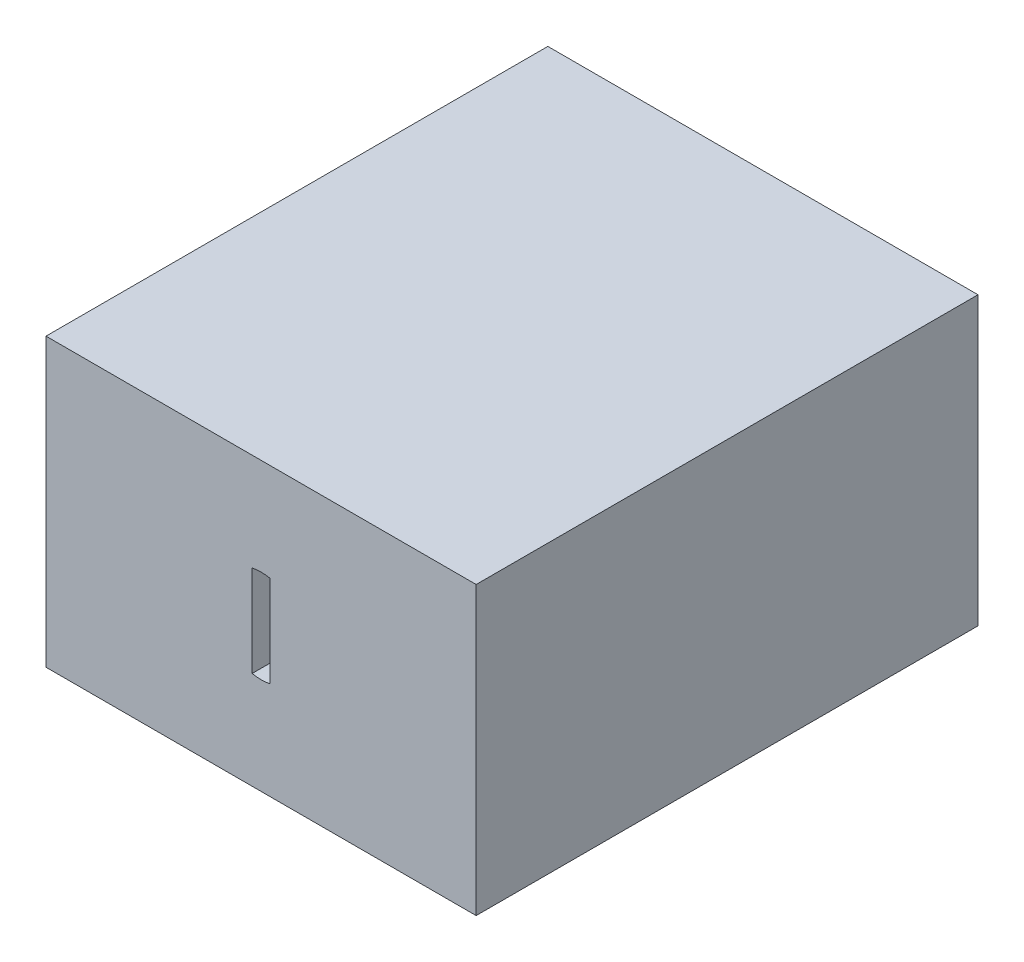
ISO-10303-21;
HEADER;
FILE_DESCRIPTION(('STEP AP214'),'2;1');
FILE_NAME('part.step','',(''),(''),'','','');
FILE_SCHEMA(('AUTOMOTIVE_DESIGN { 1 0 10303 214 1 1 1 1 }'));
ENDSEC;
DATA;
#1=APPLICATION_CONTEXT('core data for automotive mechanical design processes');
#2=APPLICATION_PROTOCOL_DEFINITION('international standard','automotive_design',2000,#1);
#3=PRODUCT_CONTEXT('',#1,'mechanical');
#4=PRODUCT('Part','Part','',(#3));
#5=PRODUCT_RELATED_PRODUCT_CATEGORY('part','',(#4));
#6=PRODUCT_DEFINITION_FORMATION('','',#4);
#7=PRODUCT_DEFINITION_CONTEXT('part definition',#1,'design');
#8=PRODUCT_DEFINITION('design','',#6,#7);
#9=PRODUCT_DEFINITION_SHAPE('','',#8);
#10=(LENGTH_UNIT() NAMED_UNIT(*) SI_UNIT(.MILLI.,.METRE.));
#11=(NAMED_UNIT(*) PLANE_ANGLE_UNIT() SI_UNIT($,.RADIAN.));
#12=(NAMED_UNIT(*) SI_UNIT($,.STERADIAN.) SOLID_ANGLE_UNIT());
#13=UNCERTAINTY_MEASURE_WITH_UNIT(LENGTH_MEASURE(1.E-05),#10,'distance_accuracy_value','');
#14=(GEOMETRIC_REPRESENTATION_CONTEXT(3) GLOBAL_UNCERTAINTY_ASSIGNED_CONTEXT((#13)) GLOBAL_UNIT_ASSIGNED_CONTEXT((#10,
#11,#12)) REPRESENTATION_CONTEXT('',''));
#15=CARTESIAN_POINT('',(0.,0.,0.));
#16=DIRECTION('',(0.,0.,1.));
#17=DIRECTION('',(1.,0.,0.));
#18=AXIS2_PLACEMENT_3D('',#15,#16,#17);
#19=CARTESIAN_POINT('',(-32.8183082101523,-7.19214017713193,-54.7013246195609));
#20=DIRECTION('',(0.,-1.,0.));
#21=DIRECTION('',(0.,0.,-1.));
#22=AXIS2_PLACEMENT_3D('',#19,#20,#21);
#23=PLANE('',#22);
#24=DIRECTION('',(-1.,0.,0.));
#25=VECTOR('',#24,1.);
#26=CARTESIAN_POINT('',(-32.8183082101523,-7.19214017713193,-62.2013246195609));
#27=LINE('',#26,#25);
#28=CARTESIAN_POINT('',(-32.8183082101523,-7.19214017713193,-62.2013246195609));
#29=VERTEX_POINT('',#28);
#30=CARTESIAN_POINT('',(-33.8933082101523,-7.19214017713193,-62.2013246195608));
#31=VERTEX_POINT('',#30);
#32=EDGE_CURVE('E422',#29,#31,#27,.T.);
#33=ORIENTED_EDGE('',*,*,#32,.T.);
#34=DIRECTION('',(0.,0.,1.));
#35=VECTOR('',#34,1.);
#36=CARTESIAN_POINT('',(-33.8933082101523,-7.19214017713193,-58.7013246195608));
#37=LINE('',#36,#35);
#38=CARTESIAN_POINT('',(-33.8933082101523,-7.19214017713193,-58.7013246195608));
#39=VERTEX_POINT('',#38);
#40=EDGE_CURVE('E282',#31,#39,#37,.T.);
#41=ORIENTED_EDGE('',*,*,#40,.T.);
#42=DIRECTION('',(0.,0.,-1.));
#43=VECTOR('',#42,1.);
#44=CARTESIAN_POINT('',(-33.8933082101523,-7.19214017713193,-54.7013246195609));
#45=LINE('',#44,#43);
#46=CARTESIAN_POINT('',(-33.8933082101523,-7.19214017713193,-54.7013246195608));
#47=VERTEX_POINT('',#46);
#48=EDGE_CURVE('E368',#47,#39,#45,.T.);
#49=ORIENTED_EDGE('',*,*,#48,.F.);
#50=DIRECTION('',(-1.,0.,0.));
#51=VECTOR('',#50,1.);
#52=CARTESIAN_POINT('',(-32.8183082101523,-7.19214017713193,-54.7013246195609));
#53=LINE('',#52,#51);
#54=CARTESIAN_POINT('',(-32.8183082101523,-7.19214017713193,-54.7013246195609));
#55=VERTEX_POINT('',#54);
#56=EDGE_CURVE('E398',#55,#47,#53,.T.);
#57=ORIENTED_EDGE('',*,*,#56,.F.);
#58=DIRECTION('',(0.,0.,-1.));
#59=VECTOR('',#58,1.);
#60=CARTESIAN_POINT('',(-32.8183082101523,-7.19214017713193,-54.7013246195609));
#61=LINE('',#60,#59);
#62=EDGE_CURVE('E444',#55,#29,#61,.T.);
#63=ORIENTED_EDGE('',*,*,#62,.T.);
#64=EDGE_LOOP('',(#33,#41,#49,#57,#63));
#65=FACE_BOUND('',#64,.T.);
#66=ADVANCED_FACE('F39',(#65),#23,.F.);
#67=DIRECTION('',(0.,0.,1.));
#68=VECTOR('',#67,1.);
#69=CARTESIAN_POINT('',(-38.0933082101523,-7.19214017713193,-54.7013246195609));
#70=LINE('',#69,#68);
#71=CARTESIAN_POINT('',(-38.0933082101523,-7.19214017713193,-58.7013246195608));
#72=VERTEX_POINT('',#71);
#73=CARTESIAN_POINT('',(-38.0933082101523,-7.19214017713193,-54.7013246195609));
#74=VERTEX_POINT('',#73);
#75=EDGE_CURVE('E373',#72,#74,#70,.T.);
#76=ORIENTED_EDGE('',*,*,#75,.F.);
#77=DIRECTION('',(0.,0.,-1.));
#78=VECTOR('',#77,1.);
#79=CARTESIAN_POINT('',(-38.0933082101523,-7.19214017713193,-58.7013246195608));
#80=LINE('',#79,#78);
#81=CARTESIAN_POINT('',(-38.0933082101523,-7.19214017713193,-62.2013246195608));
#82=VERTEX_POINT('',#81);
#83=EDGE_CURVE('E294',#72,#82,#80,.T.);
#84=ORIENTED_EDGE('',*,*,#83,.T.);
#85=CARTESIAN_POINT('',(-39.1683082101523,-7.19214017713193,-62.2013246195609));
#86=VERTEX_POINT('',#85);
#87=EDGE_CURVE('E421',#82,#86,#27,.T.);
#88=ORIENTED_EDGE('',*,*,#87,.T.);
#89=DIRECTION('',(0.,0.,-1.));
#90=VECTOR('',#89,1.);
#91=CARTESIAN_POINT('',(-39.1683082101523,-7.19214017713193,-54.7013246195609));
#92=LINE('',#91,#90);
#93=CARTESIAN_POINT('',(-39.1683082101523,-7.19214017713193,-54.7013246195609));
#94=VERTEX_POINT('',#93);
#95=EDGE_CURVE('E441',#94,#86,#92,.T.);
#96=ORIENTED_EDGE('',*,*,#95,.F.);
#97=EDGE_CURVE('E397',#74,#94,#53,.T.);
#98=ORIENTED_EDGE('',*,*,#97,.F.);
#99=EDGE_LOOP('',(#76,#84,#88,#96,#98));
#100=FACE_BOUND('',#99,.T.);
#101=ADVANCED_FACE('F495',(#100),#23,.F.);
#102=DIRECTION('',(-1.,0.,0.));
#103=VECTOR('',#102,1.);
#104=CARTESIAN_POINT('',(-32.8183082101523,-7.19214017713193,-58.7013246195608));
#105=LINE('',#104,#103);
#106=CARTESIAN_POINT('',(-34.2933082101523,-7.19214017713193,-58.7013246195608));
#107=VERTEX_POINT('',#106);
#108=CARTESIAN_POINT('',(-37.6933082101523,-7.19214017713193,-58.7013246195608));
#109=VERTEX_POINT('',#108);
#110=EDGE_CURVE('E376',#107,#109,#105,.T.);
#111=ORIENTED_EDGE('',*,*,#110,.F.);
#112=DIRECTION('',(0.,0.,-1.));
#113=VECTOR('',#112,1.);
#114=CARTESIAN_POINT('',(-34.2933082101523,-7.19214017713193,-58.7013246195608));
#115=LINE('',#114,#113);
#116=CARTESIAN_POINT('',(-34.2933082101523,-7.19214017713193,-62.2013246195608));
#117=VERTEX_POINT('',#116);
#118=EDGE_CURVE('E277',#107,#117,#115,.T.);
#119=ORIENTED_EDGE('',*,*,#118,.T.);
#120=CARTESIAN_POINT('',(-37.6933082101523,-7.19214017713193,-62.2013246195608));
#121=VERTEX_POINT('',#120);
#122=EDGE_CURVE('E426',#117,#121,#27,.T.);
#123=ORIENTED_EDGE('',*,*,#122,.T.);
#124=DIRECTION('',(0.,0.,1.));
#125=VECTOR('',#124,1.);
#126=CARTESIAN_POINT('',(-37.6933082101523,-7.19214017713193,-58.7013246195608));
#127=LINE('',#126,#125);
#128=EDGE_CURVE('E300',#121,#109,#127,.T.);
#129=ORIENTED_EDGE('',*,*,#128,.T.);
#130=EDGE_LOOP('',(#111,#119,#123,#129));
#131=FACE_BOUND('',#130,.T.);
#132=ADVANCED_FACE('F516',(#131),#23,.F.);
#133=CARTESIAN_POINT('',(-33.8183082101523,-0.842140177131929,-54.7013246195609));
#134=DIRECTION('',(0.,1.,0.));
#135=DIRECTION('',(0.,0.,1.));
#136=AXIS2_PLACEMENT_3D('',#133,#134,#135);
#137=PLANE('',#136);
#138=DIRECTION('',(0.,0.,-1.));
#139=VECTOR('',#138,1.);
#140=CARTESIAN_POINT('',(-38.0933082101523,-0.842140177131929,-54.7013246195609));
#141=LINE('',#140,#139);
#142=CARTESIAN_POINT('',(-38.0933082101523,-0.842140177131929,-54.7013246195608));
#143=VERTEX_POINT('',#142);
#144=CARTESIAN_POINT('',(-38.0933082101523,-0.842140177131929,-58.7013246195608));
#145=VERTEX_POINT('',#144);
#146=EDGE_CURVE('E371',#143,#145,#141,.T.);
#147=ORIENTED_EDGE('',*,*,#146,.F.);
#148=DIRECTION('',(1.,0.,0.));
#149=VECTOR('',#148,1.);
#150=CARTESIAN_POINT('',(-38.1683082101523,-0.842140177131929,-54.7013246195609));
#151=LINE('',#150,#149);
#152=CARTESIAN_POINT('',(-39.1683082101523,-0.842140177131929,-54.7013246195609));
#153=VERTEX_POINT('',#152);
#154=EDGE_CURVE('E385',#153,#143,#151,.T.);
#155=ORIENTED_EDGE('',*,*,#154,.F.);
#156=DIRECTION('',(0.,0.,-1.));
#157=VECTOR('',#156,1.);
#158=CARTESIAN_POINT('',(-39.1683082101523,-0.842140177131929,-54.7013246195609));
#159=LINE('',#158,#157);
#160=CARTESIAN_POINT('',(-39.1683082101523,-0.842140177131929,-62.2013246195609));
#161=VERTEX_POINT('',#160);
#162=EDGE_CURVE('E434',#153,#161,#159,.T.);
#163=ORIENTED_EDGE('',*,*,#162,.T.);
#164=DIRECTION('',(1.,0.,0.));
#165=VECTOR('',#164,1.);
#166=CARTESIAN_POINT('',(-33.8183082101523,-0.842140177131929,-62.2013246195609));
#167=LINE('',#166,#165);
#168=CARTESIAN_POINT('',(-32.8183082101523,-0.842140177131929,-62.2013246195609));
#169=VERTEX_POINT('',#168);
#170=EDGE_CURVE('E384',#161,#169,#167,.T.);
#171=ORIENTED_EDGE('',*,*,#170,.T.);
#172=DIRECTION('',(0.,0.,-1.));
#173=VECTOR('',#172,1.);
#174=CARTESIAN_POINT('',(-32.8183082101523,-0.842140177131929,-54.7013246195609));
#175=LINE('',#174,#173);
#176=CARTESIAN_POINT('',(-32.8183082101523,-0.842140177131929,-54.7013246195609));
#177=VERTEX_POINT('',#176);
#178=EDGE_CURVE('E409',#177,#169,#175,.T.);
#179=ORIENTED_EDGE('',*,*,#178,.F.);
#180=CARTESIAN_POINT('',(-33.8933082101523,-0.842140177131929,-54.7013246195609));
#181=VERTEX_POINT('',#180);
#182=EDGE_CURVE('E389',#181,#177,#151,.T.);
#183=ORIENTED_EDGE('',*,*,#182,.F.);
#184=DIRECTION('',(0.,0.,1.));
#185=VECTOR('',#184,1.);
#186=CARTESIAN_POINT('',(-33.8933082101523,-0.842140177131929,-54.7013246195609));
#187=LINE('',#186,#185);
#188=CARTESIAN_POINT('',(-33.8933082101523,-0.842140177131929,-58.7013246195608));
#189=VERTEX_POINT('',#188);
#190=EDGE_CURVE('E343',#189,#181,#187,.T.);
#191=ORIENTED_EDGE('',*,*,#190,.F.);
#192=DIRECTION('',(1.,0.,0.));
#193=VECTOR('',#192,1.);
#194=CARTESIAN_POINT('',(-33.8183082101523,-0.842140177131929,-58.7013246195608));
#195=LINE('',#194,#193);
#196=EDGE_CURVE('E455',#145,#189,#195,.T.);
#197=ORIENTED_EDGE('',*,*,#196,.F.);
#198=EDGE_LOOP('',(#147,#155,#163,#171,#179,#183,#191,#197));
#199=FACE_BOUND('',#198,.T.);
#200=ADVANCED_FACE('F561',(#199),#137,.F.);
#201=CARTESIAN_POINT('',(-27.9933082101526,0.982859822868071,-62.2013246195609));
#202=DIRECTION('',(0.,0.,1.));
#203=DIRECTION('',(1.,0.,0.));
#204=AXIS2_PLACEMENT_3D('',#201,#202,#203);
#205=PLANE('',#204);
#206=ORIENTED_EDGE('',*,*,#122,.F.);
#207=DIRECTION('',(1.,0.,0.));
#208=VECTOR('',#207,1.);
#209=CARTESIAN_POINT('',(-27.9933082101526,-7.19214017713196,-62.2013246195609));
#210=LINE('',#209,#208);
#211=EDGE_CURVE('E476',#117,#31,#210,.T.);
#212=ORIENTED_EDGE('',*,*,#211,.T.);
#213=ORIENTED_EDGE('',*,*,#32,.F.);
#214=DIRECTION('',(0.,-1.,0.));
#215=VECTOR('',#214,1.);
#216=CARTESIAN_POINT('',(-32.8183082101523,-4.81714017713193,-62.2013246195609));
#217=LINE('',#216,#215);
#218=CARTESIAN_POINT('',(-32.8183082101523,-4.81714017713193,-62.2013246195609));
#219=VERTEX_POINT('',#218);
#220=EDGE_CURVE('E418',#219,#29,#217,.T.);
#221=ORIENTED_EDGE('',*,*,#220,.F.);
#222=CARTESIAN_POINT('',(-32.8183082101523,-4.01714017713193,-62.2013246195609));
#223=DIRECTION('',(0.,0.,-1.));
#224=DIRECTION('',(-1.,0.,0.));
#225=AXIS2_PLACEMENT_3D('',#222,#223,#224);
#226=CIRCLE('',#225,0.8);
#227=CARTESIAN_POINT('',(-32.8183082101523,-3.21714017713193,-62.2013246195609));
#228=VERTEX_POINT('',#227);
#229=EDGE_CURVE('E415',#228,#219,#226,.T.);
#230=ORIENTED_EDGE('',*,*,#229,.F.);
#231=DIRECTION('',(0.,-1.,0.));
#232=VECTOR('',#231,1.);
#233=CARTESIAN_POINT('',(-32.8183082101523,-1.84214017713193,-62.2013246195609));
#234=LINE('',#233,#232);
#235=EDGE_CURVE('E412',#169,#228,#234,.T.);
#236=ORIENTED_EDGE('',*,*,#235,.F.);
#237=ORIENTED_EDGE('',*,*,#170,.F.);
#238=DIRECTION('',(0.,1.,0.));
#239=VECTOR('',#238,1.);
#240=CARTESIAN_POINT('',(-39.1683082101523,-0.842140177131929,-62.2013246195609));
#241=LINE('',#240,#239);
#242=CARTESIAN_POINT('',(-39.1683082101523,-3.21714017713193,-62.2013246195609));
#243=VERTEX_POINT('',#242);
#244=EDGE_CURVE('E432',#243,#161,#241,.T.);
#245=ORIENTED_EDGE('',*,*,#244,.F.);
#246=CARTESIAN_POINT('',(-39.1683082101523,-4.01714017713193,-62.2013246195609));
#247=DIRECTION('',(0.,0.,-1.));
#248=DIRECTION('',(1.,0.,0.));
#249=AXIS2_PLACEMENT_3D('',#246,#247,#248);
#250=CIRCLE('',#249,0.8);
#251=CARTESIAN_POINT('',(-39.1683082101523,-4.81714017713193,-62.2013246195609));
#252=VERTEX_POINT('',#251);
#253=EDGE_CURVE('E429',#252,#243,#250,.T.);
#254=ORIENTED_EDGE('',*,*,#253,.F.);
#255=DIRECTION('',(0.,1.,0.));
#256=VECTOR('',#255,1.);
#257=CARTESIAN_POINT('',(-39.1683082101523,-4.81714017713193,-62.2013246195609));
#258=LINE('',#257,#256);
#259=EDGE_CURVE('E425',#86,#252,#258,.T.);
#260=ORIENTED_EDGE('',*,*,#259,.F.);
#261=ORIENTED_EDGE('',*,*,#87,.F.);
#262=DIRECTION('',(1.,0.,0.));
#263=VECTOR('',#262,1.);
#264=CARTESIAN_POINT('',(-27.9933082101526,-7.19214017713196,-62.2013246195609));
#265=LINE('',#264,#263);
#266=EDGE_CURVE('E473',#82,#121,#265,.T.);
#267=ORIENTED_EDGE('',*,*,#266,.T.);
#268=EDGE_LOOP('',(#206,#212,#213,#221,#230,#236,#237,#245,#254,#260,#261,#267));
#269=FACE_BOUND('',#268,.T.);
#270=DIRECTION('',(0.,1.,0.));
#271=VECTOR('',#270,1.);
#272=CARTESIAN_POINT('',(-41.9933082101523,0.982859822868071,-62.2013246195609));
#273=LINE('',#272,#271);
#274=CARTESIAN_POINT('',(-41.9933082101523,-8.01714017713193,-62.2013246195609));
#275=VERTEX_POINT('',#274);
#276=CARTESIAN_POINT('',(-41.9933082101523,-0.0171401771319295,-62.2013246195609));
#277=VERTEX_POINT('',#276);
#278=EDGE_CURVE('E274',#275,#277,#273,.T.);
#279=ORIENTED_EDGE('',*,*,#278,.T.);
#280=DIRECTION('',(-1.,0.,0.));
#281=VECTOR('',#280,1.);
#282=CARTESIAN_POINT('',(-41.9933082101523,-0.0171401771319295,-62.2013246195609));
#283=LINE('',#282,#281);
#284=CARTESIAN_POINT('',(-29.9933082101523,-0.0171401771319295,-62.2013246195609));
#285=VERTEX_POINT('',#284);
#286=EDGE_CURVE('E255',#285,#277,#283,.T.);
#287=ORIENTED_EDGE('',*,*,#286,.F.);
#288=DIRECTION('',(0.,-1.,0.));
#289=VECTOR('',#288,1.);
#290=CARTESIAN_POINT('',(-29.9933082101523,0.982859822868071,-62.2013246195609));
#291=LINE('',#290,#289);
#292=CARTESIAN_POINT('',(-29.9933082101523,-8.01714017713193,-62.2013246195609));
#293=VERTEX_POINT('',#292);
#294=EDGE_CURVE('E270',#285,#293,#291,.T.);
#295=ORIENTED_EDGE('',*,*,#294,.T.);
#296=DIRECTION('',(1.,0.,0.));
#297=VECTOR('',#296,1.);
#298=CARTESIAN_POINT('',(-29.9933082101523,-8.01714017713193,-62.2013246195609));
#299=LINE('',#298,#297);
#300=EDGE_CURVE('E250',#275,#293,#299,.T.);
#301=ORIENTED_EDGE('',*,*,#300,.F.);
#302=EDGE_LOOP('',(#279,#287,#295,#301));
#303=FACE_BOUND('',#302,.T.);
#304=ADVANCED_FACE('F501',(#269,#303),#205,.F.);
#305=CARTESIAN_POINT('',(-29.9933082101523,23.4550648771123,-60.2013246195608));
#306=DIRECTION('',(-1.,0.,0.));
#307=DIRECTION('',(0.,0.,1.));
#308=AXIS2_PLACEMENT_3D('',#305,#306,#307);
#309=PLANE('',#308);
#310=ORIENTED_EDGE('',*,*,#294,.F.);
#311=DIRECTION('',(0.,0.,1.));
#312=VECTOR('',#311,1.);
#313=CARTESIAN_POINT('',(-29.9933082101523,-0.0171401771319295,-60.2013246195608));
#314=LINE('',#313,#312);
#315=CARTESIAN_POINT('',(-29.9933082101523,-0.0171401771319295,-48.2013246195609));
#316=VERTEX_POINT('',#315);
#317=EDGE_CURVE('E265',#285,#316,#314,.T.);
#318=ORIENTED_EDGE('',*,*,#317,.T.);
#319=DIRECTION('',(0.,1.,0.));
#320=VECTOR('',#319,1.);
#321=CARTESIAN_POINT('',(-29.9933082101523,-0.0171401771319295,-48.2013246195609));
#322=LINE('',#321,#320);
#323=CARTESIAN_POINT('',(-29.9933082101523,-8.01714017713193,-48.2013246195609));
#324=VERTEX_POINT('',#323);
#325=EDGE_CURVE('E261',#324,#316,#322,.T.);
#326=ORIENTED_EDGE('',*,*,#325,.F.);
#327=DIRECTION('',(0.,0.,-1.));
#328=VECTOR('',#327,1.);
#329=CARTESIAN_POINT('',(-29.9933082101523,-8.01714017713193,-48.2013246195609));
#330=LINE('',#329,#328);
#331=EDGE_CURVE('E244',#324,#293,#330,.T.);
#332=ORIENTED_EDGE('',*,*,#331,.T.);
#333=EDGE_LOOP('',(#310,#318,#326,#332));
#334=FACE_BOUND('',#333,.T.);
#335=ADVANCED_FACE('F264',(#334),#309,.F.);
#336=CARTESIAN_POINT('',(-39.4933082101523,23.4550648771123,-48.2013246195609));
#337=DIRECTION('',(0.,0.,-1.));
#338=DIRECTION('',(-1.,0.,0.));
#339=AXIS2_PLACEMENT_3D('',#336,#337,#338);
#340=PLANE('',#339);
#341=DIRECTION('',(0.,-1.,0.));
#342=VECTOR('',#341,1.);
#343=CARTESIAN_POINT('',(-35.7433082101523,-0.0171401771319295,-48.2013246195609));
#344=LINE('',#343,#342);
#345=CARTESIAN_POINT('',(-35.7433082101523,-2.74140509491462,-48.2013246195609));
#346=VERTEX_POINT('',#345);
#347=CARTESIAN_POINT('',(-35.7433082101523,-5.29287525934924,-48.2013246195609));
#348=VERTEX_POINT('',#347);
#349=EDGE_CURVE('E313',#346,#348,#344,.T.);
#350=ORIENTED_EDGE('',*,*,#349,.T.);
#351=CARTESIAN_POINT('',(-35.9933082101523,-4.01714017713193,-48.2013246195609));
#352=DIRECTION('',(0.,0.,-1.));
#353=DIRECTION('',(-1.,0.,0.));
#354=AXIS2_PLACEMENT_3D('',#351,#352,#353);
#355=CIRCLE('',#354,1.3);
#356=CARTESIAN_POINT('',(-36.2433082101523,-5.29287525934924,-48.2013246195609));
#357=VERTEX_POINT('',#356);
#358=EDGE_CURVE('E379',#357,#348,#355,.F.);
#359=ORIENTED_EDGE('',*,*,#358,.F.);
#360=DIRECTION('',(0.,1.,0.));
#361=VECTOR('',#360,1.);
#362=CARTESIAN_POINT('',(-36.2433082101523,-0.0171401771319295,-48.2013246195609));
#363=LINE('',#362,#361);
#364=CARTESIAN_POINT('',(-36.2433082101523,-2.74140509491462,-48.2013246195609));
#365=VERTEX_POINT('',#364);
#366=EDGE_CURVE('E319',#357,#365,#363,.T.);
#367=ORIENTED_EDGE('',*,*,#366,.T.);
#368=EDGE_CURVE('E378',#346,#365,#355,.F.);
#369=ORIENTED_EDGE('',*,*,#368,.F.);
#370=EDGE_LOOP('',(#350,#359,#367,#369));
#371=FACE_BOUND('',#370,.T.);
#372=DIRECTION('',(-1.,0.,0.));
#373=VECTOR('',#372,1.);
#374=CARTESIAN_POINT('',(-39.4933082101523,-0.0171401771319295,-48.2013246195609));
#375=LINE('',#374,#373);
#376=CARTESIAN_POINT('',(-41.9933082101523,-0.0171401771319295,-48.2013246195609));
#377=VERTEX_POINT('',#376);
#378=EDGE_CURVE('E452',#316,#377,#375,.T.);
#379=ORIENTED_EDGE('',*,*,#378,.T.);
#380=DIRECTION('',(0.,-1.,0.));
#381=VECTOR('',#380,1.);
#382=CARTESIAN_POINT('',(-41.9933082101523,-0.0171401771319295,-48.2013246195609));
#383=LINE('',#382,#381);
#384=CARTESIAN_POINT('',(-41.9933082101523,-8.01714017713193,-48.2013246195609));
#385=VERTEX_POINT('',#384);
#386=EDGE_CURVE('E262',#377,#385,#383,.T.);
#387=ORIENTED_EDGE('',*,*,#386,.T.);
#388=DIRECTION('',(1.,0.,0.));
#389=VECTOR('',#388,1.);
#390=CARTESIAN_POINT('',(-29.9933082101523,-8.01714017713193,-48.2013246195609));
#391=LINE('',#390,#389);
#392=EDGE_CURVE('E247',#385,#324,#391,.T.);
#393=ORIENTED_EDGE('',*,*,#392,.T.);
#394=ORIENTED_EDGE('',*,*,#325,.T.);
#395=EDGE_LOOP('',(#379,#387,#393,#394));
#396=FACE_BOUND('',#395,.T.);
#397=ADVANCED_FACE('F260',(#371,#396),#340,.F.);
#398=CARTESIAN_POINT('',(-41.9933082101523,23.4550648771123,-60.2013246195608));
#399=DIRECTION('',(1.,0.,0.));
#400=DIRECTION('',(0.,0.,-1.));
#401=AXIS2_PLACEMENT_3D('',#398,#399,#400);
#402=PLANE('',#401);
#403=DIRECTION('',(0.,0.,-1.));
#404=VECTOR('',#403,1.);
#405=CARTESIAN_POINT('',(-41.9933082101523,-0.0171401771319295,-60.2013246195608));
#406=LINE('',#405,#404);
#407=EDGE_CURVE('E54',#377,#277,#406,.T.);
#408=ORIENTED_EDGE('',*,*,#407,.T.);
#409=ORIENTED_EDGE('',*,*,#278,.F.);
#410=DIRECTION('',(0.,0.,1.));
#411=VECTOR('',#410,1.);
#412=CARTESIAN_POINT('',(-41.9933082101523,-8.01714017713193,-60.2013246195608));
#413=LINE('',#412,#411);
#414=EDGE_CURVE('E12',#275,#385,#413,.T.);
#415=ORIENTED_EDGE('',*,*,#414,.T.);
#416=ORIENTED_EDGE('',*,*,#386,.F.);
#417=EDGE_LOOP('',(#408,#409,#415,#416));
#418=FACE_BOUND('',#417,.T.);
#419=ADVANCED_FACE('F620',(#418),#402,.F.);
#420=CARTESIAN_POINT('',(-35.9933082101523,-0.0171401771319295,25.7986753804392));
#421=DIRECTION('',(0.,-1.,0.));
#422=DIRECTION('',(0.,0.,-1.));
#423=AXIS2_PLACEMENT_3D('',#420,#421,#422);
#424=PLANE('',#423);
#425=ORIENTED_EDGE('',*,*,#407,.F.);
#426=ORIENTED_EDGE('',*,*,#378,.F.);
#427=ORIENTED_EDGE('',*,*,#317,.F.);
#428=ORIENTED_EDGE('',*,*,#286,.T.);
#429=EDGE_LOOP('',(#425,#426,#427,#428));
#430=FACE_BOUND('',#429,.T.);
#431=ADVANCED_FACE('F617',(#430),#424,.F.);
#432=CARTESIAN_POINT('',(-39.1683082101523,-0.842140177131929,-54.7013246195609));
#433=DIRECTION('',(-1.,0.,0.));
#434=DIRECTION('',(0.,-1.,0.));
#435=AXIS2_PLACEMENT_3D('',#432,#433,#434);
#436=PLANE('',#435);
#437=ORIENTED_EDGE('',*,*,#244,.T.);
#438=ORIENTED_EDGE('',*,*,#162,.F.);
#439=DIRECTION('',(0.,1.,0.));
#440=VECTOR('',#439,1.);
#441=CARTESIAN_POINT('',(-39.1683082101523,-1.84214017713193,-54.7013246195609));
#442=LINE('',#441,#440);
#443=CARTESIAN_POINT('',(-39.1683082101523,-3.21714017713193,-54.7013246195609));
#444=VERTEX_POINT('',#443);
#445=EDGE_CURVE('E407',#444,#153,#442,.T.);
#446=ORIENTED_EDGE('',*,*,#445,.F.);
#447=DIRECTION('',(0.,0.,-1.));
#448=VECTOR('',#447,1.);
#449=CARTESIAN_POINT('',(-39.1683082101523,-3.21714017713193,-54.7013246195609));
#450=LINE('',#449,#448);
#451=EDGE_CURVE('E437',#444,#243,#450,.T.);
#452=ORIENTED_EDGE('',*,*,#451,.T.);
#453=EDGE_LOOP('',(#437,#438,#446,#452));
#454=FACE_BOUND('',#453,.T.);
#455=ADVANCED_FACE('F556',(#454),#436,.F.);
#456=CARTESIAN_POINT('',(-39.1683082101523,-4.01714017713193,-54.7013246195609));
#457=DIRECTION('',(0.,0.,-1.));
#458=DIRECTION('',(-1.,0.,0.));
#459=AXIS2_PLACEMENT_3D('',#456,#457,#458);
#460=CYLINDRICAL_SURFACE('',#459,0.8);
#461=ORIENTED_EDGE('',*,*,#253,.T.);
#462=ORIENTED_EDGE('',*,*,#451,.F.);
#463=CARTESIAN_POINT('',(-39.1683082101523,-4.01714017713193,-54.7013246195609));
#464=DIRECTION('',(0.,0.,-1.));
#465=DIRECTION('',(1.,0.,0.));
#466=AXIS2_PLACEMENT_3D('',#463,#464,#465);
#467=CIRCLE('',#466,0.8);
#468=CARTESIAN_POINT('',(-39.1683082101523,-4.81714017713193,-54.7013246195609));
#469=VERTEX_POINT('',#468);
#470=EDGE_CURVE('E404',#469,#444,#467,.T.);
#471=ORIENTED_EDGE('',*,*,#470,.F.);
#472=DIRECTION('',(0.,0.,-1.));
#473=VECTOR('',#472,1.);
#474=CARTESIAN_POINT('',(-39.1683082101523,-4.81714017713193,-54.7013246195609));
#475=LINE('',#474,#473);
#476=EDGE_CURVE('E439',#469,#252,#475,.T.);
#477=ORIENTED_EDGE('',*,*,#476,.T.);
#478=EDGE_LOOP('',(#461,#462,#471,#477));
#479=FACE_BOUND('',#478,.T.);
#480=ADVANCED_FACE('F551',(#479),#460,.F.);
#481=CARTESIAN_POINT('',(-39.1683082101523,-4.81714017713193,-54.7013246195609));
#482=DIRECTION('',(-1.,0.,0.));
#483=DIRECTION('',(0.,-1.,0.));
#484=AXIS2_PLACEMENT_3D('',#481,#482,#483);
#485=PLANE('',#484);
#486=ORIENTED_EDGE('',*,*,#259,.T.);
#487=ORIENTED_EDGE('',*,*,#476,.F.);
#488=DIRECTION('',(0.,1.,0.));
#489=VECTOR('',#488,1.);
#490=CARTESIAN_POINT('',(-39.1683082101523,-4.81714017713193,-54.7013246195609));
#491=LINE('',#490,#489);
#492=EDGE_CURVE('E401',#94,#469,#491,.T.);
#493=ORIENTED_EDGE('',*,*,#492,.F.);
#494=ORIENTED_EDGE('',*,*,#95,.T.);
#495=EDGE_LOOP('',(#486,#487,#493,#494));
#496=FACE_BOUND('',#495,.T.);
#497=ADVANCED_FACE('F548',(#496),#485,.F.);
#498=CARTESIAN_POINT('',(-32.8183082101523,-4.81714017713193,-54.7013246195609));
#499=DIRECTION('',(1.,0.,0.));
#500=DIRECTION('',(0.,0.,-1.));
#501=AXIS2_PLACEMENT_3D('',#498,#499,#500);
#502=PLANE('',#501);
#503=ORIENTED_EDGE('',*,*,#220,.T.);
#504=ORIENTED_EDGE('',*,*,#62,.F.);
#505=DIRECTION('',(0.,-1.,0.));
#506=VECTOR('',#505,1.);
#507=CARTESIAN_POINT('',(-32.8183082101523,-4.81714017713193,-54.7013246195609));
#508=LINE('',#507,#506);
#509=CARTESIAN_POINT('',(-32.8183082101523,-4.81714017713193,-54.7013246195609));
#510=VERTEX_POINT('',#509);
#511=EDGE_CURVE('E394',#510,#55,#508,.T.);
#512=ORIENTED_EDGE('',*,*,#511,.F.);
#513=DIRECTION('',(0.,0.,-1.));
#514=VECTOR('',#513,1.);
#515=CARTESIAN_POINT('',(-32.8183082101523,-4.81714017713193,-54.7013246195609));
#516=LINE('',#515,#514);
#517=EDGE_CURVE('E446',#510,#219,#516,.T.);
#518=ORIENTED_EDGE('',*,*,#517,.T.);
#519=EDGE_LOOP('',(#503,#504,#512,#518));
#520=FACE_BOUND('',#519,.T.);
#521=ADVANCED_FACE('F592',(#520),#502,.F.);
#522=CARTESIAN_POINT('',(-32.8183082101523,-4.01714017713193,-54.7013246195609));
#523=DIRECTION('',(0.,0.,-1.));
#524=DIRECTION('',(-1.,0.,0.));
#525=AXIS2_PLACEMENT_3D('',#522,#523,#524);
#526=CYLINDRICAL_SURFACE('',#525,0.8);
#527=ORIENTED_EDGE('',*,*,#229,.T.);
#528=ORIENTED_EDGE('',*,*,#517,.F.);
#529=CARTESIAN_POINT('',(-32.8183082101523,-4.01714017713193,-54.7013246195609));
#530=DIRECTION('',(0.,0.,-1.));
#531=DIRECTION('',(-1.,0.,0.));
#532=AXIS2_PLACEMENT_3D('',#529,#530,#531);
#533=CIRCLE('',#532,0.8);
#534=CARTESIAN_POINT('',(-32.8183082101523,-3.21714017713193,-54.7013246195609));
#535=VERTEX_POINT('',#534);
#536=EDGE_CURVE('E391',#535,#510,#533,.T.);
#537=ORIENTED_EDGE('',*,*,#536,.F.);
#538=DIRECTION('',(0.,0.,-1.));
#539=VECTOR('',#538,1.);
#540=CARTESIAN_POINT('',(-32.8183082101523,-3.21714017713193,-54.7013246195609));
#541=LINE('',#540,#539);
#542=EDGE_CURVE('E448',#535,#228,#541,.T.);
#543=ORIENTED_EDGE('',*,*,#542,.T.);
#544=EDGE_LOOP('',(#527,#528,#537,#543));
#545=FACE_BOUND('',#544,.T.);
#546=ADVANCED_FACE('F588',(#545),#526,.F.);
#547=CARTESIAN_POINT('',(-32.8183082101523,-1.84214017713193,-54.7013246195609));
#548=DIRECTION('',(1.,0.,0.));
#549=DIRECTION('',(0.,1.,0.));
#550=AXIS2_PLACEMENT_3D('',#547,#548,#549);
#551=PLANE('',#550);
#552=ORIENTED_EDGE('',*,*,#235,.T.);
#553=ORIENTED_EDGE('',*,*,#542,.F.);
#554=DIRECTION('',(0.,-1.,0.));
#555=VECTOR('',#554,1.);
#556=CARTESIAN_POINT('',(-32.8183082101523,-0.842140177131929,-54.7013246195609));
#557=LINE('',#556,#555);
#558=EDGE_CURVE('E388',#177,#535,#557,.T.);
#559=ORIENTED_EDGE('',*,*,#558,.F.);
#560=ORIENTED_EDGE('',*,*,#178,.T.);
#561=EDGE_LOOP('',(#552,#553,#559,#560));
#562=FACE_BOUND('',#561,.T.);
#563=ADVANCED_FACE('F584',(#562),#551,.F.);
#564=CARTESIAN_POINT('',(-39.1683082101523,-4.01714017713193,-54.7013246195609));
#565=DIRECTION('',(0.,0.,1.));
#566=DIRECTION('',(1.,0.,0.));
#567=AXIS2_PLACEMENT_3D('',#564,#565,#566);
#568=PLANE('',#567);
#569=CARTESIAN_POINT('',(-35.9933082101523,-4.01714017713193,-54.7013246195609));
#570=DIRECTION('',(0.,0.,-1.));
#571=DIRECTION('',(-1.,0.,0.));
#572=AXIS2_PLACEMENT_3D('',#569,#570,#571);
#573=CIRCLE('',#572,1.3);
#574=CARTESIAN_POINT('',(-37.2933082101523,-4.01714017713193,-54.7013246195609));
#575=VERTEX_POINT('',#574);
#576=EDGE_CURVE('E381',#575,#575,#573,.T.);
#577=ORIENTED_EDGE('',*,*,#576,.F.);
#578=EDGE_LOOP('',(#577));
#579=FACE_BOUND('',#578,.T.);
#580=ORIENTED_EDGE('',*,*,#56,.T.);
#581=DIRECTION('',(0.,1.,0.));
#582=VECTOR('',#581,1.);
#583=CARTESIAN_POINT('',(-33.8933082101523,-13.7921401771319,-54.7013246195608));
#584=LINE('',#583,#582);
#585=CARTESIAN_POINT('',(-33.8933082101523,-7.59214017713193,-54.7013246195608));
#586=VERTEX_POINT('',#585);
#587=EDGE_CURVE('E353',#586,#47,#584,.T.);
#588=ORIENTED_EDGE('',*,*,#587,.F.);
#589=DIRECTION('',(-1.,0.,0.));
#590=VECTOR('',#589,1.);
#591=CARTESIAN_POINT('',(-38.0933082101523,-7.59214017713193,-54.7013246195608));
#592=LINE('',#591,#590);
#593=CARTESIAN_POINT('',(-38.0933082101523,-7.59214017713193,-54.7013246195608));
#594=VERTEX_POINT('',#593);
#595=EDGE_CURVE('E350',#586,#594,#592,.T.);
#596=ORIENTED_EDGE('',*,*,#595,.T.);
#597=DIRECTION('',(0.,1.,0.));
#598=VECTOR('',#597,1.);
#599=CARTESIAN_POINT('',(-38.0933082101523,-13.7921401771319,-54.7013246195608));
#600=LINE('',#599,#598);
#601=EDGE_CURVE('E364',#594,#74,#600,.T.);
#602=ORIENTED_EDGE('',*,*,#601,.T.);
#603=ORIENTED_EDGE('',*,*,#97,.T.);
#604=ORIENTED_EDGE('',*,*,#492,.T.);
#605=ORIENTED_EDGE('',*,*,#470,.T.);
#606=ORIENTED_EDGE('',*,*,#445,.T.);
#607=ORIENTED_EDGE('',*,*,#154,.T.);
#608=CARTESIAN_POINT('',(-38.0933082101523,-0.442140177131929,-54.7013246195608));
#609=VERTEX_POINT('',#608);
#610=EDGE_CURVE('E339',#143,#609,#600,.T.);
#611=ORIENTED_EDGE('',*,*,#610,.T.);
#612=DIRECTION('',(-1.,0.,0.));
#613=VECTOR('',#612,1.);
#614=CARTESIAN_POINT('',(-38.0933082101523,-0.442140177131929,-54.7013246195608));
#615=LINE('',#614,#613);
#616=CARTESIAN_POINT('',(-33.8933082101523,-0.442140177131929,-54.7013246195608));
#617=VERTEX_POINT('',#616);
#618=EDGE_CURVE('E336',#617,#609,#615,.T.);
#619=ORIENTED_EDGE('',*,*,#618,.F.);
#620=EDGE_CURVE('E362',#181,#617,#584,.T.);
#621=ORIENTED_EDGE('',*,*,#620,.F.);
#622=ORIENTED_EDGE('',*,*,#182,.T.);
#623=ORIENTED_EDGE('',*,*,#558,.T.);
#624=ORIENTED_EDGE('',*,*,#536,.T.);
#625=ORIENTED_EDGE('',*,*,#511,.T.);
#626=EDGE_LOOP('',(#580,#588,#596,#602,#603,#604,#605,#606,#607,#611,#619,#621,#622,#623,#624,#625));
#627=FACE_BOUND('',#626,.T.);
#628=ADVANCED_FACE('F540',(#579,#627),#568,.F.);
#629=CARTESIAN_POINT('',(-35.9933082101523,-4.01714017713193,62.7996753804392));
#630=DIRECTION('',(0.,0.,-1.));
#631=DIRECTION('',(-1.,0.,0.));
#632=AXIS2_PLACEMENT_3D('',#629,#630,#631);
#633=CYLINDRICAL_SURFACE('',#632,1.3);
#634=ORIENTED_EDGE('',*,*,#576,.T.);
#635=EDGE_LOOP('',(#634));
#636=FACE_BOUND('',#635,.T.);
#637=CARTESIAN_POINT('',(-35.9933082101523,-4.01714017713193,-49.2013246195609));
#638=DIRECTION('',(0.,0.,1.));
#639=DIRECTION('',(1.,0.,0.));
#640=AXIS2_PLACEMENT_3D('',#637,#638,#639);
#641=CIRCLE('',#640,1.3);
#642=CARTESIAN_POINT('',(-35.7433082101523,-2.74140509491462,-49.2013246195609));
#643=VERTEX_POINT('',#642);
#644=CARTESIAN_POINT('',(-35.7433082101523,-5.29287525934924,-49.2013246195609));
#645=VERTEX_POINT('',#644);
#646=EDGE_CURVE('E465',#643,#645,#641,.F.);
#647=ORIENTED_EDGE('',*,*,#646,.F.);
#648=DIRECTION('',(0.,0.,-1.));
#649=VECTOR('',#648,1.);
#650=CARTESIAN_POINT('',(-35.7433082101523,-2.74140509491462,62.7996753804392));
#651=LINE('',#650,#649);
#652=EDGE_CURVE('E470',#643,#346,#651,.F.);
#653=ORIENTED_EDGE('',*,*,#652,.T.);
#654=ORIENTED_EDGE('',*,*,#368,.T.);
#655=DIRECTION('',(0.,0.,-1.));
#656=VECTOR('',#655,1.);
#657=CARTESIAN_POINT('',(-36.2433082101523,-2.74140509491462,62.7996753804392));
#658=LINE('',#657,#656);
#659=CARTESIAN_POINT('',(-36.2433082101523,-2.74140509491462,-49.2013246195609));
#660=VERTEX_POINT('',#659);
#661=EDGE_CURVE('E460',#365,#660,#658,.T.);
#662=ORIENTED_EDGE('',*,*,#661,.T.);
#663=CARTESIAN_POINT('',(-35.9933082101523,-4.01714017713193,-49.2013246195609));
#664=DIRECTION('',(0.,0.,1.));
#665=DIRECTION('',(1.,0.,0.));
#666=AXIS2_PLACEMENT_3D('',#663,#664,#665);
#667=CIRCLE('',#666,1.3);
#668=CARTESIAN_POINT('',(-36.2433082101523,-5.29287525934924,-49.2013246195609));
#669=VERTEX_POINT('',#668);
#670=EDGE_CURVE('E457',#669,#660,#667,.F.);
#671=ORIENTED_EDGE('',*,*,#670,.F.);
#672=DIRECTION('',(0.,0.,-1.));
#673=VECTOR('',#672,1.);
#674=CARTESIAN_POINT('',(-36.2433082101523,-5.29287525934924,62.7996753804392));
#675=LINE('',#674,#673);
#676=EDGE_CURVE('E462',#669,#357,#675,.F.);
#677=ORIENTED_EDGE('',*,*,#676,.T.);
#678=ORIENTED_EDGE('',*,*,#358,.T.);
#679=DIRECTION('',(0.,0.,-1.));
#680=VECTOR('',#679,1.);
#681=CARTESIAN_POINT('',(-35.7433082101523,-5.29287525934924,62.7996753804392));
#682=LINE('',#681,#680);
#683=EDGE_CURVE('E468',#348,#645,#682,.T.);
#684=ORIENTED_EDGE('',*,*,#683,.T.);
#685=EDGE_LOOP('',(#647,#653,#654,#662,#671,#677,#678,#684));
#686=FACE_BOUND('',#685,.T.);
#687=ADVANCED_FACE('F668',(#636,#686),#633,.F.);
#688=CARTESIAN_POINT('',(-35.9933082101523,-0.442140177131929,25.7986753804392));
#689=DIRECTION('',(0.,-1.,0.));
#690=DIRECTION('',(0.,0.,-1.));
#691=AXIS2_PLACEMENT_3D('',#688,#689,#690);
#692=PLANE('',#691);
#693=DIRECTION('',(0.,0.,-1.));
#694=VECTOR('',#693,1.);
#695=CARTESIAN_POINT('',(-38.0933082101523,-0.442140177131929,-54.7013246195608));
#696=LINE('',#695,#694);
#697=CARTESIAN_POINT('',(-38.0933082101523,-0.442140177131929,-58.7013246195608));
#698=VERTEX_POINT('',#697);
#699=EDGE_CURVE('E325',#609,#698,#696,.T.);
#700=ORIENTED_EDGE('',*,*,#699,.T.);
#701=DIRECTION('',(1.,0.,0.));
#702=VECTOR('',#701,1.);
#703=CARTESIAN_POINT('',(-38.0933082101523,-0.442140177131929,-58.7013246195608));
#704=LINE('',#703,#702);
#705=CARTESIAN_POINT('',(-33.8933082101523,-0.442140177131929,-58.7013246195608));
#706=VERTEX_POINT('',#705);
#707=EDGE_CURVE('E330',#698,#706,#704,.T.);
#708=ORIENTED_EDGE('',*,*,#707,.T.);
#709=DIRECTION('',(0.,0.,1.));
#710=VECTOR('',#709,1.);
#711=CARTESIAN_POINT('',(-33.8933082101523,-0.442140177131929,-54.7013246195608));
#712=LINE('',#711,#710);
#713=EDGE_CURVE('E333',#706,#617,#712,.T.);
#714=ORIENTED_EDGE('',*,*,#713,.T.);
#715=ORIENTED_EDGE('',*,*,#618,.T.);
#716=EDGE_LOOP('',(#700,#708,#714,#715));
#717=FACE_BOUND('',#716,.T.);
#718=ADVANCED_FACE('F574',(#717),#692,.T.);
#719=CARTESIAN_POINT('',(-33.8933082101523,-13.7921401771319,-54.7013246195608));
#720=DIRECTION('',(-1.,0.,0.));
#721=DIRECTION('',(0.,0.,1.));
#722=AXIS2_PLACEMENT_3D('',#719,#720,#721);
#723=PLANE('',#722);
#724=ORIENTED_EDGE('',*,*,#190,.T.);
#725=ORIENTED_EDGE('',*,*,#620,.T.);
#726=ORIENTED_EDGE('',*,*,#713,.F.);
#727=DIRECTION('',(0.,1.,0.));
#728=VECTOR('',#727,1.);
#729=CARTESIAN_POINT('',(-33.8933082101523,-13.7921401771319,-58.7013246195608));
#730=LINE('',#729,#728);
#731=EDGE_CURVE('E357',#189,#706,#730,.T.);
#732=ORIENTED_EDGE('',*,*,#731,.F.);
#733=EDGE_LOOP('',(#724,#725,#726,#732));
#734=FACE_BOUND('',#733,.T.);
#735=ADVANCED_FACE('F579',(#734),#723,.T.);
#736=CARTESIAN_POINT('',(-38.0933082101523,-13.7921401771319,-58.7013246195608));
#737=DIRECTION('',(0.,0.,1.));
#738=DIRECTION('',(1.,0.,0.));
#739=AXIS2_PLACEMENT_3D('',#736,#737,#738);
#740=PLANE('',#739);
#741=ORIENTED_EDGE('',*,*,#196,.T.);
#742=ORIENTED_EDGE('',*,*,#731,.T.);
#743=ORIENTED_EDGE('',*,*,#707,.F.);
#744=DIRECTION('',(0.,1.,0.));
#745=VECTOR('',#744,1.);
#746=CARTESIAN_POINT('',(-38.0933082101523,-13.7921401771319,-58.7013246195608));
#747=LINE('',#746,#745);
#748=EDGE_CURVE('E358',#145,#698,#747,.T.);
#749=ORIENTED_EDGE('',*,*,#748,.F.);
#750=EDGE_LOOP('',(#741,#742,#743,#749));
#751=FACE_BOUND('',#750,.T.);
#752=ADVANCED_FACE('F570',(#751),#740,.T.);
#753=CARTESIAN_POINT('',(-38.0933082101523,-13.7921401771319,-54.7013246195608));
#754=DIRECTION('',(1.,0.,0.));
#755=DIRECTION('',(0.,0.,-1.));
#756=AXIS2_PLACEMENT_3D('',#753,#754,#755);
#757=PLANE('',#756);
#758=ORIENTED_EDGE('',*,*,#146,.T.);
#759=ORIENTED_EDGE('',*,*,#748,.T.);
#760=ORIENTED_EDGE('',*,*,#699,.F.);
#761=ORIENTED_EDGE('',*,*,#610,.F.);
#762=EDGE_LOOP('',(#758,#759,#760,#761));
#763=FACE_BOUND('',#762,.T.);
#764=ADVANCED_FACE('F566',(#763),#757,.T.);
#765=CARTESIAN_POINT('',(-33.8933082101523,-7.59214017713193,-58.7013246195608));
#766=VERTEX_POINT('',#765);
#767=EDGE_CURVE('E359',#766,#39,#730,.T.);
#768=ORIENTED_EDGE('',*,*,#767,.T.);
#769=DIRECTION('',(0.,-1.,0.));
#770=VECTOR('',#769,1.);
#771=CARTESIAN_POINT('',(-33.8933082101523,-6.99214017713193,-58.7013246195608));
#772=LINE('',#771,#770);
#773=CARTESIAN_POINT('',(-33.8933082101523,-6.99214017713193,-58.7013246195608));
#774=VERTEX_POINT('',#773);
#775=EDGE_CURVE('E292',#774,#39,#772,.T.);
#776=ORIENTED_EDGE('',*,*,#775,.F.);
#777=DIRECTION('',(-1.,0.,0.));
#778=VECTOR('',#777,1.);
#779=CARTESIAN_POINT('',(-33.8933082101523,-6.99214017713193,-58.7013246195608));
#780=LINE('',#779,#778);
#781=CARTESIAN_POINT('',(-34.2933082101523,-6.99214017713193,-58.7013246195608));
#782=VERTEX_POINT('',#781);
#783=EDGE_CURVE('E278',#774,#782,#780,.T.);
#784=ORIENTED_EDGE('',*,*,#783,.T.);
#785=DIRECTION('',(0.,-1.,0.));
#786=VECTOR('',#785,1.);
#787=CARTESIAN_POINT('',(-34.2933082101523,-6.99214017713193,-58.7013246195608));
#788=LINE('',#787,#786);
#789=EDGE_CURVE('E287',#782,#107,#788,.T.);
#790=ORIENTED_EDGE('',*,*,#789,.T.);
#791=ORIENTED_EDGE('',*,*,#110,.T.);
#792=DIRECTION('',(0.,-1.,0.));
#793=VECTOR('',#792,1.);
#794=CARTESIAN_POINT('',(-37.6933082101523,-6.99214017713193,-58.7013246195608));
#795=LINE('',#794,#793);
#796=CARTESIAN_POINT('',(-37.6933082101523,-6.99214017713193,-58.7013246195608));
#797=VERTEX_POINT('',#796);
#798=EDGE_CURVE('E305',#797,#109,#795,.T.);
#799=ORIENTED_EDGE('',*,*,#798,.F.);
#800=DIRECTION('',(-1.,0.,0.));
#801=VECTOR('',#800,1.);
#802=CARTESIAN_POINT('',(-38.0933082101523,-6.99214017713193,-58.7013246195608));
#803=LINE('',#802,#801);
#804=CARTESIAN_POINT('',(-38.0933082101523,-6.99214017713193,-58.7013246195608));
#805=VERTEX_POINT('',#804);
#806=EDGE_CURVE('E302',#797,#805,#803,.T.);
#807=ORIENTED_EDGE('',*,*,#806,.T.);
#808=DIRECTION('',(0.,-1.,0.));
#809=VECTOR('',#808,1.);
#810=CARTESIAN_POINT('',(-38.0933082101523,-6.99214017713193,-58.7013246195608));
#811=LINE('',#810,#809);
#812=EDGE_CURVE('E310',#805,#72,#811,.T.);
#813=ORIENTED_EDGE('',*,*,#812,.T.);
#814=CARTESIAN_POINT('',(-38.0933082101523,-7.59214017713193,-58.7013246195608));
#815=VERTEX_POINT('',#814);
#816=EDGE_CURVE('E354',#815,#72,#747,.T.);
#817=ORIENTED_EDGE('',*,*,#816,.F.);
#818=DIRECTION('',(1.,0.,0.));
#819=VECTOR('',#818,1.);
#820=CARTESIAN_POINT('',(-38.0933082101523,-7.59214017713193,-58.7013246195608));
#821=LINE('',#820,#819);
#822=EDGE_CURVE('E344',#815,#766,#821,.T.);
#823=ORIENTED_EDGE('',*,*,#822,.T.);
#824=EDGE_LOOP('',(#768,#776,#784,#790,#791,#799,#807,#813,#817,#823));
#825=FACE_BOUND('',#824,.T.);
#826=ADVANCED_FACE('F512',(#825),#740,.T.);
#827=ORIENTED_EDGE('',*,*,#75,.T.);
#828=ORIENTED_EDGE('',*,*,#601,.F.);
#829=DIRECTION('',(0.,0.,-1.));
#830=VECTOR('',#829,1.);
#831=CARTESIAN_POINT('',(-38.0933082101523,-7.59214017713193,-54.7013246195608));
#832=LINE('',#831,#830);
#833=EDGE_CURVE('E347',#594,#815,#832,.T.);
#834=ORIENTED_EDGE('',*,*,#833,.T.);
#835=ORIENTED_EDGE('',*,*,#816,.T.);
#836=EDGE_LOOP('',(#827,#828,#834,#835));
#837=FACE_BOUND('',#836,.T.);
#838=ADVANCED_FACE('F545',(#837),#757,.T.);
#839=ORIENTED_EDGE('',*,*,#48,.T.);
#840=ORIENTED_EDGE('',*,*,#767,.F.);
#841=DIRECTION('',(0.,0.,1.));
#842=VECTOR('',#841,1.);
#843=CARTESIAN_POINT('',(-33.8933082101523,-7.59214017713193,-54.7013246195608));
#844=LINE('',#843,#842);
#845=EDGE_CURVE('E340',#766,#586,#844,.T.);
#846=ORIENTED_EDGE('',*,*,#845,.T.);
#847=ORIENTED_EDGE('',*,*,#587,.T.);
#848=EDGE_LOOP('',(#839,#840,#846,#847));
#849=FACE_BOUND('',#848,.T.);
#850=ADVANCED_FACE('F537',(#849),#723,.T.);
#851=CARTESIAN_POINT('',(-32.8183082101523,-7.59214017713193,-54.7013246195609));
#852=DIRECTION('',(0.,-1.,0.));
#853=DIRECTION('',(0.,0.,-1.));
#854=AXIS2_PLACEMENT_3D('',#851,#852,#853);
#855=PLANE('',#854);
#856=ORIENTED_EDGE('',*,*,#595,.F.);
#857=ORIENTED_EDGE('',*,*,#845,.F.);
#858=ORIENTED_EDGE('',*,*,#822,.F.);
#859=ORIENTED_EDGE('',*,*,#833,.F.);
#860=EDGE_LOOP('',(#856,#857,#858,#859));
#861=FACE_BOUND('',#860,.T.);
#862=ADVANCED_FACE('F543',(#861),#855,.F.);
#863=CARTESIAN_POINT('',(-36.2433082101523,-0.0171401771319295,-49.2013246195609));
#864=DIRECTION('',(1.,0.,0.));
#865=DIRECTION('',(0.,1.,0.));
#866=AXIS2_PLACEMENT_3D('',#863,#864,#865);
#867=PLANE('',#866);
#868=ORIENTED_EDGE('',*,*,#676,.F.);
#869=DIRECTION('',(0.,1.,0.));
#870=VECTOR('',#869,1.);
#871=CARTESIAN_POINT('',(-36.2433082101523,-0.0171401771319295,-49.2013246195609));
#872=LINE('',#871,#870);
#873=EDGE_CURVE('E322',#669,#660,#872,.T.);
#874=ORIENTED_EDGE('',*,*,#873,.T.);
#875=ORIENTED_EDGE('',*,*,#661,.F.);
#876=ORIENTED_EDGE('',*,*,#366,.F.);
#877=EDGE_LOOP('',(#868,#874,#875,#876));
#878=FACE_BOUND('',#877,.T.);
#879=ADVANCED_FACE('F661',(#878),#867,.T.);
#880=CARTESIAN_POINT('',(-35.9933082101523,-10.0171401771319,-49.2013246195609));
#881=DIRECTION('',(0.,0.,1.));
#882=DIRECTION('',(1.,0.,0.));
#883=AXIS2_PLACEMENT_3D('',#880,#881,#882);
#884=PLANE('',#883);
#885=ORIENTED_EDGE('',*,*,#873,.F.);
#886=ORIENTED_EDGE('',*,*,#670,.T.);
#887=EDGE_LOOP('',(#885,#886));
#888=FACE_BOUND('',#887,.T.);
#889=ADVANCED_FACE('F657',(#888),#884,.F.);
#890=CARTESIAN_POINT('',(-35.7433082101523,-0.0171401771319295,-49.2013246195609));
#891=DIRECTION('',(-1.,0.,0.));
#892=DIRECTION('',(0.,-1.,0.));
#893=AXIS2_PLACEMENT_3D('',#890,#891,#892);
#894=PLANE('',#893);
#895=ORIENTED_EDGE('',*,*,#652,.F.);
#896=DIRECTION('',(0.,-1.,0.));
#897=VECTOR('',#896,1.);
#898=CARTESIAN_POINT('',(-35.7433082101523,-0.0171401771319295,-49.2013246195609));
#899=LINE('',#898,#897);
#900=EDGE_CURVE('E316',#643,#645,#899,.T.);
#901=ORIENTED_EDGE('',*,*,#900,.T.);
#902=ORIENTED_EDGE('',*,*,#683,.F.);
#903=ORIENTED_EDGE('',*,*,#349,.F.);
#904=EDGE_LOOP('',(#895,#901,#902,#903));
#905=FACE_BOUND('',#904,.T.);
#906=ADVANCED_FACE('F653',(#905),#894,.T.);
#907=CARTESIAN_POINT('',(-35.9933082101523,-10.0171401771319,-49.2013246195609));
#908=DIRECTION('',(0.,0.,1.));
#909=DIRECTION('',(1.,0.,0.));
#910=AXIS2_PLACEMENT_3D('',#907,#908,#909);
#911=PLANE('',#910);
#912=ORIENTED_EDGE('',*,*,#900,.F.);
#913=ORIENTED_EDGE('',*,*,#646,.T.);
#914=EDGE_LOOP('',(#912,#913));
#915=FACE_BOUND('',#914,.T.);
#916=ADVANCED_FACE('F650',(#915),#911,.F.);
#917=CARTESIAN_POINT('',(-38.0933082101523,-6.99214017713193,-58.7013246195608));
#918=DIRECTION('',(-1.,0.,0.));
#919=DIRECTION('',(0.,0.,1.));
#920=AXIS2_PLACEMENT_3D('',#917,#918,#919);
#921=PLANE('',#920);
#922=DIRECTION('',(0.,0.,-1.));
#923=VECTOR('',#922,1.);
#924=CARTESIAN_POINT('',(-38.0933082101523,-6.99214017713193,-58.7013246195608));
#925=LINE('',#924,#923);
#926=CARTESIAN_POINT('',(-38.0933082101523,-6.99214017713193,-62.0013246195608));
#927=VERTEX_POINT('',#926);
#928=EDGE_CURVE('E297',#805,#927,#925,.T.);
#929=ORIENTED_EDGE('',*,*,#928,.T.);
#930=DIRECTION('',(0.,0.707106781186547,0.707106781186548));
#931=VECTOR('',#930,1.);
#932=CARTESIAN_POINT('',(-38.0933082101523,-5.34214017713193,-60.3513246195608));
#933=LINE('',#932,#931);
#934=EDGE_CURVE('E47',#927,#82,#933,.F.);
#935=ORIENTED_EDGE('',*,*,#934,.T.);
#936=ORIENTED_EDGE('',*,*,#83,.F.);
#937=ORIENTED_EDGE('',*,*,#812,.F.);
#938=EDGE_LOOP('',(#929,#935,#936,#937));
#939=FACE_BOUND('',#938,.T.);
#940=ADVANCED_FACE('F489',(#939),#921,.T.);
#941=CARTESIAN_POINT('',(-37.6933082101523,-6.99214017713193,-58.7013246195608));
#942=DIRECTION('',(1.,0.,0.));
#943=DIRECTION('',(0.,0.,-1.));
#944=AXIS2_PLACEMENT_3D('',#941,#942,#943);
#945=PLANE('',#944);
#946=ORIENTED_EDGE('',*,*,#128,.F.);
#947=DIRECTION('',(0.,-0.707106781186547,-0.707106781186548));
#948=VECTOR('',#947,1.);
#949=CARTESIAN_POINT('',(-37.6933082101523,-5.34214017713193,-60.3513246195608));
#950=LINE('',#949,#948);
#951=CARTESIAN_POINT('',(-37.6933082101523,-6.99214017713193,-62.0013246195608));
#952=VERTEX_POINT('',#951);
#953=EDGE_CURVE('E485',#121,#952,#950,.F.);
#954=ORIENTED_EDGE('',*,*,#953,.T.);
#955=DIRECTION('',(0.,0.,1.));
#956=VECTOR('',#955,1.);
#957=CARTESIAN_POINT('',(-37.6933082101523,-6.99214017713193,-58.7013246195608));
#958=LINE('',#957,#956);
#959=EDGE_CURVE('E299',#952,#797,#958,.T.);
#960=ORIENTED_EDGE('',*,*,#959,.T.);
#961=ORIENTED_EDGE('',*,*,#798,.T.);
#962=EDGE_LOOP('',(#946,#954,#960,#961));
#963=FACE_BOUND('',#962,.T.);
#964=ADVANCED_FACE('F507',(#963),#945,.T.);
#965=CARTESIAN_POINT('',(-35.9933082101523,-6.99214017713193,25.7986753804392));
#966=DIRECTION('',(0.,-1.,0.));
#967=DIRECTION('',(0.,0.,-1.));
#968=AXIS2_PLACEMENT_3D('',#965,#966,#967);
#969=PLANE('',#968);
#970=ORIENTED_EDGE('',*,*,#959,.F.);
#971=DIRECTION('',(-1.,0.,0.));
#972=VECTOR('',#971,1.);
#973=CARTESIAN_POINT('',(-35.9933082101523,-6.99214017713193,-62.0013246195608));
#974=LINE('',#973,#972);
#975=EDGE_CURVE('E62',#952,#927,#974,.T.);
#976=ORIENTED_EDGE('',*,*,#975,.T.);
#977=ORIENTED_EDGE('',*,*,#928,.F.);
#978=ORIENTED_EDGE('',*,*,#806,.F.);
#979=EDGE_LOOP('',(#970,#976,#977,#978));
#980=FACE_BOUND('',#979,.T.);
#981=ADVANCED_FACE('F510',(#980),#969,.F.);
#982=CARTESIAN_POINT('',(-33.8933082101523,-6.99214017713193,-58.7013246195608));
#983=DIRECTION('',(1.,0.,0.));
#984=DIRECTION('',(0.,0.,-1.));
#985=AXIS2_PLACEMENT_3D('',#982,#983,#984);
#986=PLANE('',#985);
#987=ORIENTED_EDGE('',*,*,#40,.F.);
#988=DIRECTION('',(0.,-0.707106781186547,-0.707106781186548));
#989=VECTOR('',#988,1.);
#990=CARTESIAN_POINT('',(-33.8933082101523,-5.34214017713193,-60.3513246195608));
#991=LINE('',#990,#989);
#992=CARTESIAN_POINT('',(-33.8933082101523,-6.99214017713193,-62.0013246195608));
#993=VERTEX_POINT('',#992);
#994=EDGE_CURVE('E479',#31,#993,#991,.F.);
#995=ORIENTED_EDGE('',*,*,#994,.T.);
#996=DIRECTION('',(0.,0.,1.));
#997=VECTOR('',#996,1.);
#998=CARTESIAN_POINT('',(-33.8933082101523,-6.99214017713193,-58.7013246195608));
#999=LINE('',#998,#997);
#1000=EDGE_CURVE('E285',#993,#774,#999,.T.);
#1001=ORIENTED_EDGE('',*,*,#1000,.T.);
#1002=ORIENTED_EDGE('',*,*,#775,.T.);
#1003=EDGE_LOOP('',(#987,#995,#1001,#1002));
#1004=FACE_BOUND('',#1003,.T.);
#1005=ADVANCED_FACE('F526',(#1004),#986,.T.);
#1006=CARTESIAN_POINT('',(-34.2933082101523,-6.99214017713193,-58.7013246195608));
#1007=DIRECTION('',(-1.,0.,0.));
#1008=DIRECTION('',(0.,0.,1.));
#1009=AXIS2_PLACEMENT_3D('',#1006,#1007,#1008);
#1010=PLANE('',#1009);
#1011=DIRECTION('',(0.,0.,-1.));
#1012=VECTOR('',#1011,1.);
#1013=CARTESIAN_POINT('',(-34.2933082101523,-6.99214017713193,-58.7013246195608));
#1014=LINE('',#1013,#1012);
#1015=CARTESIAN_POINT('',(-34.2933082101523,-6.99214017713193,-62.0013246195608));
#1016=VERTEX_POINT('',#1015);
#1017=EDGE_CURVE('E281',#782,#1016,#1014,.T.);
#1018=ORIENTED_EDGE('',*,*,#1017,.T.);
#1019=DIRECTION('',(0.,0.707106781186547,0.707106781186548));
#1020=VECTOR('',#1019,1.);
#1021=CARTESIAN_POINT('',(-34.2933082101523,-5.34214017713193,-60.3513246195608));
#1022=LINE('',#1021,#1020);
#1023=EDGE_CURVE('E483',#1016,#117,#1022,.F.);
#1024=ORIENTED_EDGE('',*,*,#1023,.T.);
#1025=ORIENTED_EDGE('',*,*,#118,.F.);
#1026=ORIENTED_EDGE('',*,*,#789,.F.);
#1027=EDGE_LOOP('',(#1018,#1024,#1025,#1026));
#1028=FACE_BOUND('',#1027,.T.);
#1029=ADVANCED_FACE('F633',(#1028),#1010,.T.);
#1030=CARTESIAN_POINT('',(-35.9933082101523,-6.99214017713193,25.7986753804392));
#1031=DIRECTION('',(0.,-1.,0.));
#1032=DIRECTION('',(0.,0.,-1.));
#1033=AXIS2_PLACEMENT_3D('',#1030,#1031,#1032);
#1034=PLANE('',#1033);
#1035=ORIENTED_EDGE('',*,*,#1000,.F.);
#1036=DIRECTION('',(-1.,0.,0.));
#1037=VECTOR('',#1036,1.);
#1038=CARTESIAN_POINT('',(-35.9933082101523,-6.99214017713193,-62.0013246195608));
#1039=LINE('',#1038,#1037);
#1040=EDGE_CURVE('E481',#993,#1016,#1039,.T.);
#1041=ORIENTED_EDGE('',*,*,#1040,.T.);
#1042=ORIENTED_EDGE('',*,*,#1017,.F.);
#1043=ORIENTED_EDGE('',*,*,#783,.F.);
#1044=EDGE_LOOP('',(#1035,#1041,#1042,#1043));
#1045=FACE_BOUND('',#1044,.T.);
#1046=ADVANCED_FACE('F530',(#1045),#1034,.F.);
#1047=CARTESIAN_POINT('',(-27.9933082101526,-7.19214017713196,-62.2013246195609));
#1048=DIRECTION('',(0.,-0.707106781186548,0.707106781186547));
#1049=DIRECTION('',(1.,0.,0.));
#1050=AXIS2_PLACEMENT_3D('',#1047,#1048,#1049);
#1051=PLANE('',#1050);
#1052=ORIENTED_EDGE('',*,*,#1023,.F.);
#1053=ORIENTED_EDGE('',*,*,#1040,.F.);
#1054=ORIENTED_EDGE('',*,*,#994,.F.);
#1055=ORIENTED_EDGE('',*,*,#211,.F.);
#1056=EDGE_LOOP('',(#1052,#1053,#1054,#1055));
#1057=FACE_BOUND('',#1056,.T.);
#1058=ADVANCED_FACE('F522',(#1057),#1051,.F.);
#1059=CARTESIAN_POINT('',(-27.9933082101526,-7.19214017713196,-62.2013246195609));
#1060=DIRECTION('',(0.,-0.707106781186548,0.707106781186547));
#1061=DIRECTION('',(1.,0.,0.));
#1062=AXIS2_PLACEMENT_3D('',#1059,#1060,#1061);
#1063=PLANE('',#1062);
#1064=ORIENTED_EDGE('',*,*,#934,.F.);
#1065=ORIENTED_EDGE('',*,*,#975,.F.);
#1066=ORIENTED_EDGE('',*,*,#953,.F.);
#1067=ORIENTED_EDGE('',*,*,#266,.F.);
#1068=EDGE_LOOP('',(#1064,#1065,#1066,#1067));
#1069=FACE_BOUND('',#1068,.T.);
#1070=ADVANCED_FACE('F41',(#1069),#1063,.F.);
#1071=CARTESIAN_POINT('',(-29.9933082101523,-8.01714017713193,-48.2013246195609));
#1072=DIRECTION('',(0.,1.,0.));
#1073=DIRECTION('',(0.,0.,1.));
#1074=AXIS2_PLACEMENT_3D('',#1071,#1072,#1073);
#1075=PLANE('',#1074);
#1076=ORIENTED_EDGE('',*,*,#331,.F.);
#1077=ORIENTED_EDGE('',*,*,#392,.F.);
#1078=ORIENTED_EDGE('',*,*,#414,.F.);
#1079=ORIENTED_EDGE('',*,*,#300,.T.);
#1080=EDGE_LOOP('',(#1076,#1077,#1078,#1079));
#1081=FACE_BOUND('',#1080,.T.);
#1082=ADVANCED_FACE('F246',(#1081),#1075,.F.);
#1083=CLOSED_SHELL('',(#66,#101,#132,#200,#304,#335,#397,#419,#431,#455,#480,#497,#521,#546,
#563,#628,#687,#718,#735,#752,#764,#826,#838,#850,#862,#879,#889,#906,#916,#940,#964,#981,#1005,
#1029,#1046,#1058,#1070,#1082));
#1084=MANIFOLD_SOLID_BREP('B2',#1083);
#1085=ADVANCED_BREP_SHAPE_REPRESENTATION('',(#18,#1084),#14);
#1086=SHAPE_DEFINITION_REPRESENTATION(#9,#1085);
ENDSEC;
END-ISO-10303-21;
